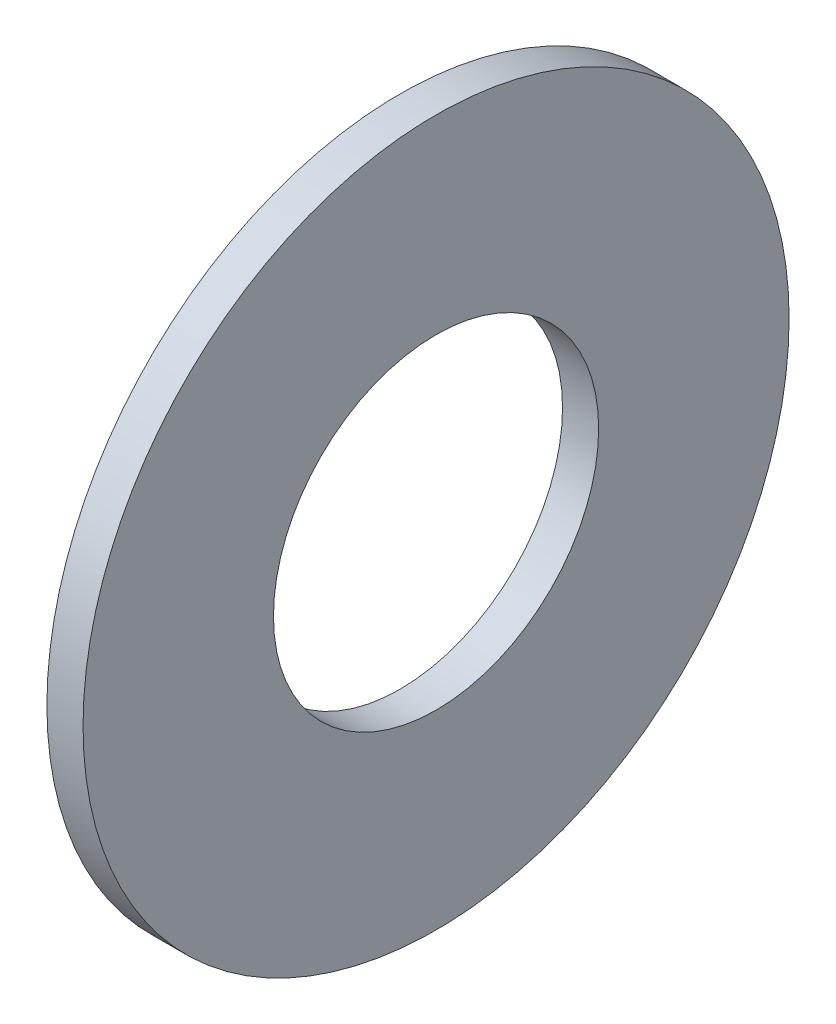
ISO-10303-21;
HEADER;
FILE_DESCRIPTION(('STEP AP214'),'2;1');
FILE_NAME('part.step','',(''),(''),'','','');
FILE_SCHEMA(('AUTOMOTIVE_DESIGN { 1 0 10303 214 1 1 1 1 }'));
ENDSEC;
DATA;
#1=APPLICATION_CONTEXT('core data for automotive mechanical design processes');
#2=APPLICATION_PROTOCOL_DEFINITION('international standard','automotive_design',2000,#1);
#3=PRODUCT_CONTEXT('',#1,'mechanical');
#4=PRODUCT('Part','Part','',(#3));
#5=PRODUCT_RELATED_PRODUCT_CATEGORY('part','',(#4));
#6=PRODUCT_DEFINITION_FORMATION('','',#4);
#7=PRODUCT_DEFINITION_CONTEXT('part definition',#1,'design');
#8=PRODUCT_DEFINITION('design','',#6,#7);
#9=PRODUCT_DEFINITION_SHAPE('','',#8);
#10=(LENGTH_UNIT() NAMED_UNIT(*) SI_UNIT(.MILLI.,.METRE.));
#11=(NAMED_UNIT(*) PLANE_ANGLE_UNIT() SI_UNIT($,.RADIAN.));
#12=(NAMED_UNIT(*) SI_UNIT($,.STERADIAN.) SOLID_ANGLE_UNIT());
#13=UNCERTAINTY_MEASURE_WITH_UNIT(LENGTH_MEASURE(1.E-05),#10,'distance_accuracy_value','');
#14=(GEOMETRIC_REPRESENTATION_CONTEXT(3) GLOBAL_UNCERTAINTY_ASSIGNED_CONTEXT((#13)) GLOBAL_UNIT_ASSIGNED_CONTEXT((#10,
#11,#12)) REPRESENTATION_CONTEXT('',''));
#15=CARTESIAN_POINT('',(0.,0.,0.));
#16=DIRECTION('',(0.,0.,1.));
#17=DIRECTION('',(1.,0.,0.));
#18=AXIS2_PLACEMENT_3D('',#15,#16,#17);
#19=CARTESIAN_POINT('',(0.5,0.,0.));
#20=DIRECTION('',(1.,0.,0.));
#21=DIRECTION('',(0.,0.,-1.));
#22=AXIS2_PLACEMENT_3D('',#19,#20,#21);
#23=PLANE('',#22);
#24=CARTESIAN_POINT('',(0.5,0.,0.));
#25=DIRECTION('',(1.,0.,0.));
#26=DIRECTION('',(0.,0.,-1.));
#27=AXIS2_PLACEMENT_3D('',#24,#25,#26);
#28=CIRCLE('',#27,4.885);
#29=CARTESIAN_POINT('',(0.5,0.,-4.885));
#30=VERTEX_POINT('',#29);
#31=EDGE_CURVE('E10',#30,#30,#28,.T.);
#32=ORIENTED_EDGE('',*,*,#31,.T.);
#33=EDGE_LOOP('',(#32));
#34=FACE_BOUND('',#33,.T.);
#35=CARTESIAN_POINT('',(0.5,0.,0.));
#36=DIRECTION('',(1.,0.,0.));
#37=DIRECTION('',(0.,0.,-1.));
#38=AXIS2_PLACEMENT_3D('',#35,#36,#37);
#39=CIRCLE('',#38,2.25);
#40=CARTESIAN_POINT('',(0.5,0.,-2.25));
#41=VERTEX_POINT('',#40);
#42=EDGE_CURVE('E41',#41,#41,#39,.T.);
#43=ORIENTED_EDGE('',*,*,#42,.F.);
#44=EDGE_LOOP('',(#43));
#45=FACE_BOUND('',#44,.T.);
#46=ADVANCED_FACE('F30',(#34,#45),#23,.T.);
#47=CARTESIAN_POINT('',(0.,0.,0.));
#48=DIRECTION('',(1.,0.,0.));
#49=DIRECTION('',(0.,0.,-1.));
#50=AXIS2_PLACEMENT_3D('',#47,#48,#49);
#51=PLANE('',#50);
#52=CARTESIAN_POINT('',(0.,0.,0.));
#53=DIRECTION('',(1.,0.,0.));
#54=DIRECTION('',(0.,0.,-1.));
#55=AXIS2_PLACEMENT_3D('',#52,#53,#54);
#56=CIRCLE('',#55,4.885);
#57=CARTESIAN_POINT('',(0.,0.,-4.885));
#58=VERTEX_POINT('',#57);
#59=EDGE_CURVE('E34',#58,#58,#56,.T.);
#60=ORIENTED_EDGE('',*,*,#59,.F.);
#61=EDGE_LOOP('',(#60));
#62=FACE_BOUND('',#61,.T.);
#63=CARTESIAN_POINT('',(0.,0.,0.));
#64=DIRECTION('',(1.,0.,0.));
#65=DIRECTION('',(0.,0.,-1.));
#66=AXIS2_PLACEMENT_3D('',#63,#64,#65);
#67=CIRCLE('',#66,2.25);
#68=CARTESIAN_POINT('',(0.,0.,-2.25));
#69=VERTEX_POINT('',#68);
#70=EDGE_CURVE('E43',#69,#69,#67,.T.);
#71=ORIENTED_EDGE('',*,*,#70,.T.);
#72=EDGE_LOOP('',(#71));
#73=FACE_BOUND('',#72,.T.);
#74=ADVANCED_FACE('F53',(#62,#73),#51,.F.);
#75=CARTESIAN_POINT('',(0.5,0.,0.));
#76=DIRECTION('',(-1.,0.,0.));
#77=DIRECTION('',(0.,0.,1.));
#78=AXIS2_PLACEMENT_3D('',#75,#76,#77);
#79=CYLINDRICAL_SURFACE('',#78,4.885);
#80=ORIENTED_EDGE('',*,*,#31,.F.);
#81=EDGE_LOOP('',(#80));
#82=FACE_BOUND('',#81,.T.);
#83=ORIENTED_EDGE('',*,*,#59,.T.);
#84=EDGE_LOOP('',(#83));
#85=FACE_BOUND('',#84,.T.);
#86=ADVANCED_FACE('F32',(#82,#85),#79,.T.);
#87=CARTESIAN_POINT('',(0.5,0.,0.));
#88=DIRECTION('',(-1.,0.,0.));
#89=DIRECTION('',(0.,0.,1.));
#90=AXIS2_PLACEMENT_3D('',#87,#88,#89);
#91=CYLINDRICAL_SURFACE('',#90,2.25);
#92=ORIENTED_EDGE('',*,*,#42,.T.);
#93=EDGE_LOOP('',(#92));
#94=FACE_BOUND('',#93,.T.);
#95=ORIENTED_EDGE('',*,*,#70,.F.);
#96=EDGE_LOOP('',(#95));
#97=FACE_BOUND('',#96,.T.);
#98=ADVANCED_FACE('F49',(#94,#97),#91,.F.);
#99=CLOSED_SHELL('',(#46,#74,#86,#98));
#100=MANIFOLD_SOLID_BREP('B2',#99);
#101=ADVANCED_BREP_SHAPE_REPRESENTATION('',(#18,#100),#14);
#102=SHAPE_DEFINITION_REPRESENTATION(#9,#101);
ENDSEC;
END-ISO-10303-21;
